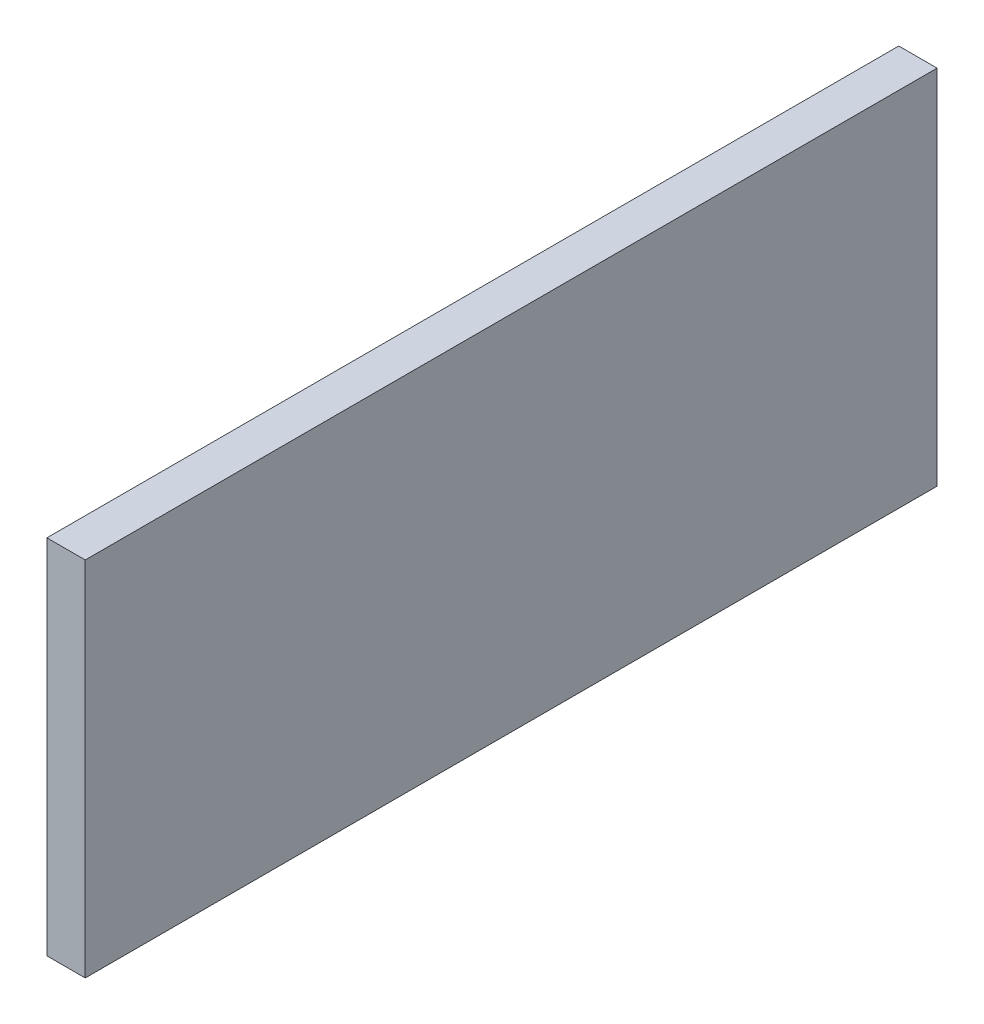
ISO-10303-21;
HEADER;
FILE_DESCRIPTION(('STEP AP214'),'2;1');
FILE_NAME('part.step','',(''),(''),'','','');
FILE_SCHEMA(('AUTOMOTIVE_DESIGN { 1 0 10303 214 1 1 1 1 }'));
ENDSEC;
DATA;
#1=APPLICATION_CONTEXT('core data for automotive mechanical design processes');
#2=APPLICATION_PROTOCOL_DEFINITION('international standard','automotive_design',2000,#1);
#3=PRODUCT_CONTEXT('',#1,'mechanical');
#4=PRODUCT('Part','Part','',(#3));
#5=PRODUCT_RELATED_PRODUCT_CATEGORY('part','',(#4));
#6=PRODUCT_DEFINITION_FORMATION('','',#4);
#7=PRODUCT_DEFINITION_CONTEXT('part definition',#1,'design');
#8=PRODUCT_DEFINITION('design','',#6,#7);
#9=PRODUCT_DEFINITION_SHAPE('','',#8);
#10=(LENGTH_UNIT() NAMED_UNIT(*) SI_UNIT(.MILLI.,.METRE.));
#11=(NAMED_UNIT(*) PLANE_ANGLE_UNIT() SI_UNIT($,.RADIAN.));
#12=(NAMED_UNIT(*) SI_UNIT($,.STERADIAN.) SOLID_ANGLE_UNIT());
#13=UNCERTAINTY_MEASURE_WITH_UNIT(LENGTH_MEASURE(1.E-05),#10,'distance_accuracy_value','');
#14=(GEOMETRIC_REPRESENTATION_CONTEXT(3) GLOBAL_UNCERTAINTY_ASSIGNED_CONTEXT((#13)) GLOBAL_UNIT_ASSIGNED_CONTEXT((#10,
#11,#12)) REPRESENTATION_CONTEXT('',''));
#15=CARTESIAN_POINT('',(0.,0.,0.));
#16=DIRECTION('',(0.,0.,1.));
#17=DIRECTION('',(1.,0.,0.));
#18=AXIS2_PLACEMENT_3D('',#15,#16,#17);
#19=CARTESIAN_POINT('',(18.,18.7522161087754,39.7681595456172));
#20=DIRECTION('',(0.,0.,-1.));
#21=DIRECTION('',(0.,1.,0.));
#22=AXIS2_PLACEMENT_3D('',#19,#20,#21);
#23=PLANE('',#22);
#24=DIRECTION('',(0.,-1.,0.));
#25=VECTOR('',#24,1.);
#26=CARTESIAN_POINT('',(0.,18.7522161087754,39.7681595456172));
#27=LINE('',#26,#25);
#28=CARTESIAN_POINT('',(0.,18.7522161087754,39.7681595456172));
#29=VERTEX_POINT('',#28);
#30=CARTESIAN_POINT('',(0.,-151.247783891225,39.7681595456172));
#31=VERTEX_POINT('',#30);
#32=EDGE_CURVE('E98',#29,#31,#27,.T.);
#33=ORIENTED_EDGE('',*,*,#32,.T.);
#34=DIRECTION('',(-1.,0.,0.));
#35=VECTOR('',#34,1.);
#36=CARTESIAN_POINT('',(18.,-151.247783891225,39.7681595456172));
#37=LINE('',#36,#35);
#38=CARTESIAN_POINT('',(18.,-151.247783891225,39.7681595456172));
#39=VERTEX_POINT('',#38);
#40=EDGE_CURVE('E11',#39,#31,#37,.T.);
#41=ORIENTED_EDGE('',*,*,#40,.F.);
#42=DIRECTION('',(0.,-1.,0.));
#43=VECTOR('',#42,1.);
#44=CARTESIAN_POINT('',(18.,18.7522161087754,39.7681595456172));
#45=LINE('',#44,#43);
#46=CARTESIAN_POINT('',(18.,18.7522161087754,39.7681595456172));
#47=VERTEX_POINT('',#46);
#48=EDGE_CURVE('E86',#47,#39,#45,.T.);
#49=ORIENTED_EDGE('',*,*,#48,.F.);
#50=DIRECTION('',(-1.,0.,0.));
#51=VECTOR('',#50,1.);
#52=CARTESIAN_POINT('',(18.,18.7522161087754,39.7681595456172));
#53=LINE('',#52,#51);
#54=EDGE_CURVE('E94',#47,#29,#53,.T.);
#55=ORIENTED_EDGE('',*,*,#54,.T.);
#56=EDGE_LOOP('',(#33,#41,#49,#55));
#57=FACE_BOUND('',#56,.T.);
#58=ADVANCED_FACE('F35',(#57),#23,.F.);
#59=CARTESIAN_POINT('',(18.,-151.247783891225,39.7681595456172));
#60=DIRECTION('',(0.,1.,0.));
#61=DIRECTION('',(0.,0.,1.));
#62=AXIS2_PLACEMENT_3D('',#59,#60,#61);
#63=PLANE('',#62);
#64=DIRECTION('',(0.,0.,-1.));
#65=VECTOR('',#64,1.);
#66=CARTESIAN_POINT('',(0.,-151.247783891225,39.7681595456172));
#67=LINE('',#66,#65);
#68=CARTESIAN_POINT('',(0.,-151.247783891225,-360.231840454383));
#69=VERTEX_POINT('',#68);
#70=EDGE_CURVE('E90',#31,#69,#67,.T.);
#71=ORIENTED_EDGE('',*,*,#70,.T.);
#72=DIRECTION('',(-1.,0.,0.));
#73=VECTOR('',#72,1.);
#74=CARTESIAN_POINT('',(18.,-151.247783891225,-360.231840454383));
#75=LINE('',#74,#73);
#76=CARTESIAN_POINT('',(18.,-151.247783891225,-360.231840454383));
#77=VERTEX_POINT('',#76);
#78=EDGE_CURVE('E43',#77,#69,#75,.T.);
#79=ORIENTED_EDGE('',*,*,#78,.F.);
#80=DIRECTION('',(0.,0.,-1.));
#81=VECTOR('',#80,1.);
#82=CARTESIAN_POINT('',(18.,-151.247783891225,39.7681595456172));
#83=LINE('',#82,#81);
#84=EDGE_CURVE('E81',#39,#77,#83,.T.);
#85=ORIENTED_EDGE('',*,*,#84,.F.);
#86=ORIENTED_EDGE('',*,*,#40,.T.);
#87=EDGE_LOOP('',(#71,#79,#85,#86));
#88=FACE_BOUND('',#87,.T.);
#89=ADVANCED_FACE('F89',(#88),#63,.F.);
#90=CARTESIAN_POINT('',(18.,18.7522161087754,-360.231840454383));
#91=DIRECTION('',(0.,0.,1.));
#92=DIRECTION('',(0.,-1.,0.));
#93=AXIS2_PLACEMENT_3D('',#90,#91,#92);
#94=PLANE('',#93);
#95=DIRECTION('',(0.,1.,0.));
#96=VECTOR('',#95,1.);
#97=CARTESIAN_POINT('',(0.,18.7522161087754,-360.231840454383));
#98=LINE('',#97,#96);
#99=CARTESIAN_POINT('',(0.,18.7522161087754,-360.231840454383));
#100=VERTEX_POINT('',#99);
#101=EDGE_CURVE('E68',#69,#100,#98,.T.);
#102=ORIENTED_EDGE('',*,*,#101,.T.);
#103=DIRECTION('',(-1.,0.,0.));
#104=VECTOR('',#103,1.);
#105=CARTESIAN_POINT('',(18.,18.7522161087754,-360.231840454383));
#106=LINE('',#105,#104);
#107=CARTESIAN_POINT('',(18.,18.7522161087754,-360.231840454383));
#108=VERTEX_POINT('',#107);
#109=EDGE_CURVE('E91',#108,#100,#106,.T.);
#110=ORIENTED_EDGE('',*,*,#109,.F.);
#111=DIRECTION('',(0.,1.,0.));
#112=VECTOR('',#111,1.);
#113=CARTESIAN_POINT('',(18.,18.7522161087754,-360.231840454383));
#114=LINE('',#113,#112);
#115=EDGE_CURVE('E84',#77,#108,#114,.T.);
#116=ORIENTED_EDGE('',*,*,#115,.F.);
#117=ORIENTED_EDGE('',*,*,#78,.T.);
#118=EDGE_LOOP('',(#102,#110,#116,#117));
#119=FACE_BOUND('',#118,.T.);
#120=ADVANCED_FACE('F92',(#119),#94,.F.);
#121=CARTESIAN_POINT('',(18.,18.7522161087754,39.7681595456172));
#122=DIRECTION('',(0.,-1.,0.));
#123=DIRECTION('',(0.,0.,-1.));
#124=AXIS2_PLACEMENT_3D('',#121,#122,#123);
#125=PLANE('',#124);
#126=DIRECTION('',(0.,0.,1.));
#127=VECTOR('',#126,1.);
#128=CARTESIAN_POINT('',(0.,18.7522161087754,39.7681595456172));
#129=LINE('',#128,#127);
#130=EDGE_CURVE('E74',#100,#29,#129,.T.);
#131=ORIENTED_EDGE('',*,*,#130,.T.);
#132=ORIENTED_EDGE('',*,*,#54,.F.);
#133=DIRECTION('',(0.,0.,1.));
#134=VECTOR('',#133,1.);
#135=CARTESIAN_POINT('',(18.,18.7522161087754,39.7681595456172));
#136=LINE('',#135,#134);
#137=EDGE_CURVE('E51',#108,#47,#136,.T.);
#138=ORIENTED_EDGE('',*,*,#137,.F.);
#139=ORIENTED_EDGE('',*,*,#109,.T.);
#140=EDGE_LOOP('',(#131,#132,#138,#139));
#141=FACE_BOUND('',#140,.T.);
#142=ADVANCED_FACE('F105',(#141),#125,.F.);
#143=CARTESIAN_POINT('',(18.,0.,0.));
#144=DIRECTION('',(1.,0.,0.));
#145=DIRECTION('',(0.,0.,-1.));
#146=AXIS2_PLACEMENT_3D('',#143,#144,#145);
#147=PLANE('',#146);
#148=ORIENTED_EDGE('',*,*,#48,.T.);
#149=ORIENTED_EDGE('',*,*,#84,.T.);
#150=ORIENTED_EDGE('',*,*,#115,.T.);
#151=ORIENTED_EDGE('',*,*,#137,.T.);
#152=EDGE_LOOP('',(#148,#149,#150,#151));
#153=FACE_BOUND('',#152,.T.);
#154=ADVANCED_FACE('F82',(#153),#147,.T.);
#155=CARTESIAN_POINT('',(0.,0.,0.));
#156=DIRECTION('',(1.,0.,0.));
#157=DIRECTION('',(0.,0.,-1.));
#158=AXIS2_PLACEMENT_3D('',#155,#156,#157);
#159=PLANE('',#158);
#160=ORIENTED_EDGE('',*,*,#32,.F.);
#161=ORIENTED_EDGE('',*,*,#130,.F.);
#162=ORIENTED_EDGE('',*,*,#101,.F.);
#163=ORIENTED_EDGE('',*,*,#70,.F.);
#164=EDGE_LOOP('',(#160,#161,#162,#163));
#165=FACE_BOUND('',#164,.T.);
#166=ADVANCED_FACE('F108',(#165),#159,.F.);
#167=CLOSED_SHELL('',(#58,#89,#120,#142,#154,#166));
#168=MANIFOLD_SOLID_BREP('B2',#167);
#169=ADVANCED_BREP_SHAPE_REPRESENTATION('',(#18,#168),#14);
#170=SHAPE_DEFINITION_REPRESENTATION(#9,#169);
ENDSEC;
END-ISO-10303-21;
